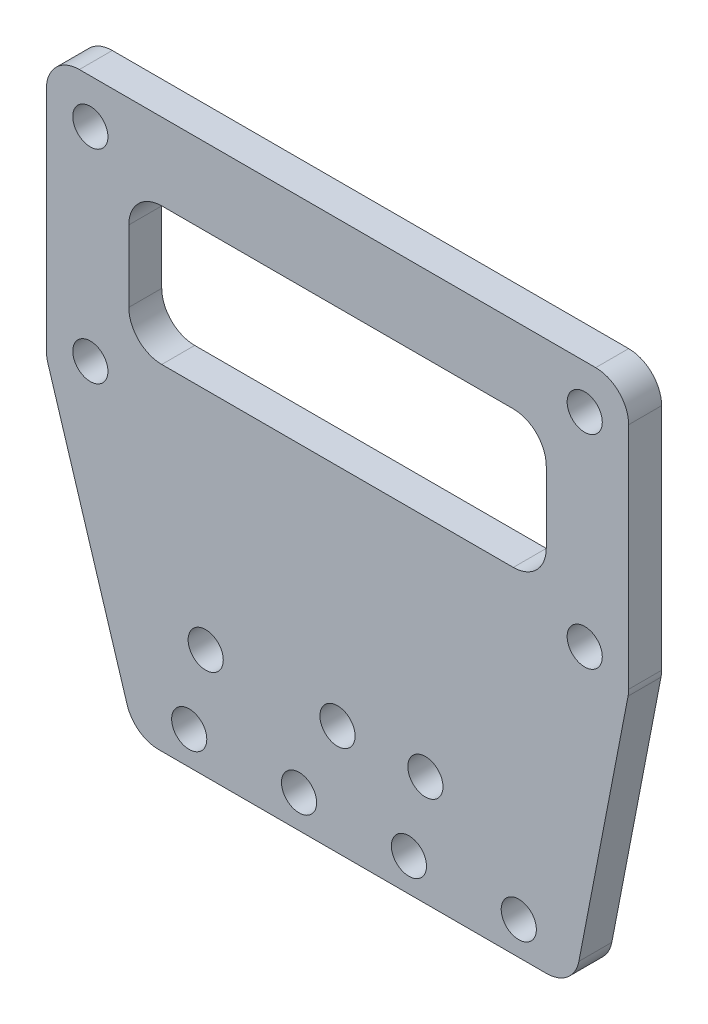
ISO-10303-21;
HEADER;
FILE_DESCRIPTION(('STEP AP214'),'2;1');
FILE_NAME('part.step','',(''),(''),'','','');
FILE_SCHEMA(('AUTOMOTIVE_DESIGN { 1 0 10303 214 1 1 1 1 }'));
ENDSEC;
DATA;
#1=APPLICATION_CONTEXT('core data for automotive mechanical design processes');
#2=APPLICATION_PROTOCOL_DEFINITION('international standard','automotive_design',2000,#1);
#3=PRODUCT_CONTEXT('',#1,'mechanical');
#4=PRODUCT('Part','Part','',(#3));
#5=PRODUCT_RELATED_PRODUCT_CATEGORY('part','',(#4));
#6=PRODUCT_DEFINITION_FORMATION('','',#4);
#7=PRODUCT_DEFINITION_CONTEXT('part definition',#1,'design');
#8=PRODUCT_DEFINITION('design','',#6,#7);
#9=PRODUCT_DEFINITION_SHAPE('','',#8);
#10=(LENGTH_UNIT() NAMED_UNIT(*) SI_UNIT(.MILLI.,.METRE.));
#11=(NAMED_UNIT(*) PLANE_ANGLE_UNIT() SI_UNIT($,.RADIAN.));
#12=(NAMED_UNIT(*) SI_UNIT($,.STERADIAN.) SOLID_ANGLE_UNIT());
#13=UNCERTAINTY_MEASURE_WITH_UNIT(LENGTH_MEASURE(1.E-05),#10,'distance_accuracy_value','');
#14=(GEOMETRIC_REPRESENTATION_CONTEXT(3) GLOBAL_UNCERTAINTY_ASSIGNED_CONTEXT((#13)) GLOBAL_UNIT_ASSIGNED_CONTEXT((#10,
#11,#12)) REPRESENTATION_CONTEXT('',''));
#15=CARTESIAN_POINT('',(0.,0.,0.));
#16=DIRECTION('',(0.,0.,1.));
#17=DIRECTION('',(1.,0.,0.));
#18=AXIS2_PLACEMENT_3D('',#15,#16,#17);
#19=CARTESIAN_POINT('',(0.,0.,3.));
#20=DIRECTION('',(0.,0.,-1.));
#21=DIRECTION('',(-1.,0.,0.));
#22=AXIS2_PLACEMENT_3D('',#19,#20,#21);
#23=PLANE('',#22);
#24=DIRECTION('',(-1.,0.,0.));
#25=VECTOR('',#24,1.);
#26=CARTESIAN_POINT('',(-40.5,43.,3.));
#27=LINE('',#26,#25);
#28=CARTESIAN_POINT('',(-5.50000000000001,43.,3.));
#29=VERTEX_POINT('',#28);
#30=CARTESIAN_POINT('',(-37.5,43.,3.));
#31=VERTEX_POINT('',#30);
#32=EDGE_CURVE('E199',#29,#31,#27,.T.);
#33=ORIENTED_EDGE('',*,*,#32,.F.);
#34=CARTESIAN_POINT('',(-5.50000000000001,40.,3.));
#35=DIRECTION('',(0.,0.,-1.));
#36=DIRECTION('',(-1.,0.,0.));
#37=AXIS2_PLACEMENT_3D('',#34,#35,#36);
#38=CIRCLE('',#37,3.);
#39=CARTESIAN_POINT('',(-2.5,40.,3.));
#40=VERTEX_POINT('',#39);
#41=EDGE_CURVE('E198',#29,#40,#38,.T.);
#42=ORIENTED_EDGE('',*,*,#41,.T.);
#43=DIRECTION('',(0.,1.,0.));
#44=VECTOR('',#43,1.);
#45=CARTESIAN_POINT('',(-2.5,43.,3.));
#46=LINE('',#45,#44);
#47=CARTESIAN_POINT('',(-2.5,33.5,3.));
#48=VERTEX_POINT('',#47);
#49=EDGE_CURVE('E189',#48,#40,#46,.T.);
#50=ORIENTED_EDGE('',*,*,#49,.F.);
#51=CARTESIAN_POINT('',(-5.5,33.5,3.));
#52=DIRECTION('',(0.,0.,-1.));
#53=DIRECTION('',(-1.,0.,0.));
#54=AXIS2_PLACEMENT_3D('',#51,#52,#53);
#55=CIRCLE('',#54,3.);
#56=CARTESIAN_POINT('',(-5.50000000000001,30.5,3.));
#57=VERTEX_POINT('',#56);
#58=EDGE_CURVE('E172',#48,#57,#55,.T.);
#59=ORIENTED_EDGE('',*,*,#58,.T.);
#60=DIRECTION('',(1.,0.,0.));
#61=VECTOR('',#60,1.);
#62=CARTESIAN_POINT('',(-40.5,30.5,3.));
#63=LINE('',#62,#61);
#64=CARTESIAN_POINT('',(-37.5,30.5,3.));
#65=VERTEX_POINT('',#64);
#66=EDGE_CURVE('E210',#65,#57,#63,.T.);
#67=ORIENTED_EDGE('',*,*,#66,.F.);
#68=CARTESIAN_POINT('',(-37.5,33.5,3.));
#69=DIRECTION('',(0.,0.,-1.));
#70=DIRECTION('',(-1.,0.,0.));
#71=AXIS2_PLACEMENT_3D('',#68,#69,#70);
#72=CIRCLE('',#71,3.);
#73=CARTESIAN_POINT('',(-40.5,33.5,3.));
#74=VERTEX_POINT('',#73);
#75=EDGE_CURVE('E42',#65,#74,#72,.T.);
#76=ORIENTED_EDGE('',*,*,#75,.T.);
#77=DIRECTION('',(0.,-1.,0.));
#78=VECTOR('',#77,1.);
#79=CARTESIAN_POINT('',(-40.5,43.,3.));
#80=LINE('',#79,#78);
#81=CARTESIAN_POINT('',(-40.5,40.,3.));
#82=VERTEX_POINT('',#81);
#83=EDGE_CURVE('E202',#82,#74,#80,.T.);
#84=ORIENTED_EDGE('',*,*,#83,.F.);
#85=CARTESIAN_POINT('',(-37.5,40.,3.));
#86=DIRECTION('',(0.,0.,-1.));
#87=DIRECTION('',(-1.,0.,0.));
#88=AXIS2_PLACEMENT_3D('',#85,#86,#87);
#89=CIRCLE('',#88,3.);
#90=EDGE_CURVE('E380',#82,#31,#89,.T.);
#91=ORIENTED_EDGE('',*,*,#90,.T.);
#92=EDGE_LOOP('',(#33,#42,#50,#59,#67,#76,#84,#91));
#93=FACE_BOUND('',#92,.T.);
#94=CARTESIAN_POINT('',(-13.5,10.,3.));
#95=DIRECTION('',(0.,0.,1.));
#96=DIRECTION('',(1.,0.,0.));
#97=AXIS2_PLACEMENT_3D('',#94,#95,#96);
#98=CIRCLE('',#97,1.6);
#99=CARTESIAN_POINT('',(-11.9,10.,3.));
#100=VERTEX_POINT('',#99);
#101=EDGE_CURVE('E222',#100,#100,#98,.T.);
#102=ORIENTED_EDGE('',*,*,#101,.F.);
#103=EDGE_LOOP('',(#102));
#104=FACE_BOUND('',#103,.T.);
#105=CARTESIAN_POINT('',(-33.5,10.,3.));
#106=DIRECTION('',(0.,0.,1.));
#107=DIRECTION('',(1.,0.,0.));
#108=AXIS2_PLACEMENT_3D('',#105,#106,#107);
#109=CIRCLE('',#108,1.6);
#110=CARTESIAN_POINT('',(-31.9,10.,3.));
#111=VERTEX_POINT('',#110);
#112=EDGE_CURVE('E216',#111,#111,#109,.T.);
#113=ORIENTED_EDGE('',*,*,#112,.F.);
#114=EDGE_LOOP('',(#113));
#115=FACE_BOUND('',#114,.T.);
#116=CARTESIAN_POINT('',(-21.5,10.,3.));
#117=DIRECTION('',(0.,0.,1.));
#118=DIRECTION('',(1.,0.,0.));
#119=AXIS2_PLACEMENT_3D('',#116,#117,#118);
#120=CIRCLE('',#119,1.6);
#121=CARTESIAN_POINT('',(-19.9,10.,3.));
#122=VERTEX_POINT('',#121);
#123=EDGE_CURVE('E215',#122,#122,#120,.T.);
#124=ORIENTED_EDGE('',*,*,#123,.F.);
#125=EDGE_LOOP('',(#124));
#126=FACE_BOUND('',#125,.T.);
#127=CARTESIAN_POINT('',(-5.,3.,3.));
#128=DIRECTION('',(0.,0.,1.));
#129=DIRECTION('',(1.,0.,0.));
#130=AXIS2_PLACEMENT_3D('',#127,#128,#129);
#131=CIRCLE('',#130,1.6);
#132=CARTESIAN_POINT('',(-3.4,3.,3.));
#133=VERTEX_POINT('',#132);
#134=EDGE_CURVE('E235',#133,#133,#131,.T.);
#135=ORIENTED_EDGE('',*,*,#134,.F.);
#136=EDGE_LOOP('',(#135));
#137=FACE_BOUND('',#136,.T.);
#138=CARTESIAN_POINT('',(-15.,2.99999999999993,3.));
#139=DIRECTION('',(0.,0.,1.));
#140=DIRECTION('',(1.,0.,0.));
#141=AXIS2_PLACEMENT_3D('',#138,#139,#140);
#142=CIRCLE('',#141,1.6);
#143=CARTESIAN_POINT('',(-13.4,2.99999999999993,3.));
#144=VERTEX_POINT('',#143);
#145=EDGE_CURVE('E241',#144,#144,#142,.T.);
#146=ORIENTED_EDGE('',*,*,#145,.F.);
#147=EDGE_LOOP('',(#146));
#148=FACE_BOUND('',#147,.T.);
#149=CARTESIAN_POINT('',(-25.,2.99999999999986,3.));
#150=DIRECTION('',(0.,0.,1.));
#151=DIRECTION('',(1.,0.,0.));
#152=AXIS2_PLACEMENT_3D('',#149,#150,#151);
#153=CIRCLE('',#152,1.6);
#154=CARTESIAN_POINT('',(-23.4,2.99999999999986,3.));
#155=VERTEX_POINT('',#154);
#156=EDGE_CURVE('E247',#155,#155,#153,.T.);
#157=ORIENTED_EDGE('',*,*,#156,.F.);
#158=EDGE_LOOP('',(#157));
#159=FACE_BOUND('',#158,.T.);
#160=CARTESIAN_POINT('',(-35.,2.99999999999979,3.));
#161=DIRECTION('',(0.,0.,1.));
#162=DIRECTION('',(1.,0.,0.));
#163=AXIS2_PLACEMENT_3D('',#160,#161,#162);
#164=CIRCLE('',#163,1.6);
#165=CARTESIAN_POINT('',(-33.4,2.99999999999979,3.));
#166=VERTEX_POINT('',#165);
#167=EDGE_CURVE('E228',#166,#166,#164,.T.);
#168=ORIENTED_EDGE('',*,*,#167,.F.);
#169=EDGE_LOOP('',(#168));
#170=FACE_BOUND('',#169,.T.);
#171=DIRECTION('',(1.,0.,0.));
#172=VECTOR('',#171,1.);
#173=CARTESIAN_POINT('',(0.,0.,3.));
#174=LINE('',#173,#172);
#175=CARTESIAN_POINT('',(-37.7879124649345,0.,3.));
#176=VERTEX_POINT('',#175);
#177=CARTESIAN_POINT('',(-2.4754339502552,0.,3.));
#178=VERTEX_POINT('',#177);
#179=EDGE_CURVE('E293',#176,#178,#174,.T.);
#180=ORIENTED_EDGE('',*,*,#179,.T.);
#181=CARTESIAN_POINT('',(-2.4754339502552,3.,3.));
#182=DIRECTION('',(0.,0.,-1.));
#183=DIRECTION('',(-1.,0.,0.));
#184=AXIS2_PLACEMENT_3D('',#181,#182,#183);
#185=CIRCLE('',#184,3.);
#186=CARTESIAN_POINT('',(0.469996972827484,2.43040656837679,3.));
#187=VERTEX_POINT('',#186);
#188=EDGE_CURVE('E356',#178,#187,#185,.F.);
#189=ORIENTED_EDGE('',*,*,#188,.T.);
#190=DIRECTION('',(0.189864477207736,0.981810307694227,0.));
#191=VECTOR('',#190,1.);
#192=CARTESIAN_POINT('',(5.,25.8555555555556,3.));
#193=LINE('',#192,#191);
#194=CARTESIAN_POINT('',(4.94543092308268,25.5733727955853,3.));
#195=VERTEX_POINT('',#194);
#196=EDGE_CURVE('E279',#187,#195,#193,.T.);
#197=ORIENTED_EDGE('',*,*,#196,.T.);
#198=CARTESIAN_POINT('',(2.,26.1429662272085,3.));
#199=DIRECTION('',(0.,0.,-1.));
#200=DIRECTION('',(-1.,0.,0.));
#201=AXIS2_PLACEMENT_3D('',#198,#199,#200);
#202=CIRCLE('',#201,3.);
#203=CARTESIAN_POINT('',(5.,26.1429662272085,3.));
#204=VERTEX_POINT('',#203);
#205=EDGE_CURVE('E354',#195,#204,#202,.F.);
#206=ORIENTED_EDGE('',*,*,#205,.T.);
#207=DIRECTION('',(0.,1.,0.));
#208=VECTOR('',#207,1.);
#209=CARTESIAN_POINT('',(5.,50.,3.));
#210=LINE('',#209,#208);
#211=CARTESIAN_POINT('',(5.,47.,3.));
#212=VERTEX_POINT('',#211);
#213=EDGE_CURVE('E282',#204,#212,#210,.T.);
#214=ORIENTED_EDGE('',*,*,#213,.T.);
#215=CARTESIAN_POINT('',(1.99999999999999,47.,3.));
#216=DIRECTION('',(0.,0.,-1.));
#217=DIRECTION('',(-1.,0.,0.));
#218=AXIS2_PLACEMENT_3D('',#215,#216,#217);
#219=CIRCLE('',#218,3.);
#220=CARTESIAN_POINT('',(1.99999999999999,50.,3.));
#221=VERTEX_POINT('',#220);
#222=EDGE_CURVE('E352',#212,#221,#219,.F.);
#223=ORIENTED_EDGE('',*,*,#222,.T.);
#224=DIRECTION('',(-1.,0.,0.));
#225=VECTOR('',#224,1.);
#226=CARTESIAN_POINT('',(-48.,50.,3.));
#227=LINE('',#226,#225);
#228=CARTESIAN_POINT('',(-45.,50.,3.));
#229=VERTEX_POINT('',#228);
#230=EDGE_CURVE('E286',#221,#229,#227,.T.);
#231=ORIENTED_EDGE('',*,*,#230,.T.);
#232=CARTESIAN_POINT('',(-45.,47.,3.));
#233=DIRECTION('',(0.,0.,-1.));
#234=DIRECTION('',(-1.,0.,0.));
#235=AXIS2_PLACEMENT_3D('',#232,#233,#234);
#236=CIRCLE('',#235,3.);
#237=CARTESIAN_POINT('',(-48.,47.,3.));
#238=VERTEX_POINT('',#237);
#239=EDGE_CURVE('E350',#229,#238,#236,.F.);
#240=ORIENTED_EDGE('',*,*,#239,.T.);
#241=DIRECTION('',(0.,-1.,0.));
#242=VECTOR('',#241,1.);
#243=CARTESIAN_POINT('',(-48.,25.8555555555555,3.));
#244=LINE('',#243,#242);
#245=CARTESIAN_POINT('',(-48.,26.3090662418019,3.));
#246=VERTEX_POINT('',#245);
#247=EDGE_CURVE('E289',#238,#246,#244,.T.);
#248=ORIENTED_EDGE('',*,*,#247,.T.);
#249=CARTESIAN_POINT('',(-45.,26.3090662418019,3.));
#250=DIRECTION('',(0.,0.,-1.));
#251=DIRECTION('',(-1.,0.,0.));
#252=AXIS2_PLACEMENT_3D('',#249,#250,#251);
#253=CIRCLE('',#252,3.);
#254=CARTESIAN_POINT('',(-47.8659487690914,25.4223094245497,3.));
#255=VERTEX_POINT('',#254);
#256=EDGE_CURVE('E56',#246,#255,#253,.F.);
#257=ORIENTED_EDGE('',*,*,#256,.T.);
#258=DIRECTION('',(0.295585605750729,-0.955316256363815,0.));
#259=VECTOR('',#258,1.);
#260=CARTESIAN_POINT('',(-40.,0.,3.));
#261=LINE('',#260,#259);
#262=CARTESIAN_POINT('',(-40.653861234026,2.11324318274781,3.));
#263=VERTEX_POINT('',#262);
#264=EDGE_CURVE('E291',#255,#263,#261,.T.);
#265=ORIENTED_EDGE('',*,*,#264,.T.);
#266=CARTESIAN_POINT('',(-37.7879124649345,3.,3.));
#267=DIRECTION('',(0.,0.,-1.));
#268=DIRECTION('',(-1.,0.,0.));
#269=AXIS2_PLACEMENT_3D('',#266,#267,#268);
#270=CIRCLE('',#269,3.);
#271=EDGE_CURVE('E347',#263,#176,#270,.F.);
#272=ORIENTED_EDGE('',*,*,#271,.T.);
#273=EDGE_LOOP('',(#180,#189,#197,#206,#214,#223,#231,#240,#248,#257,#265,#272));
#274=FACE_BOUND('',#273,.T.);
#275=CARTESIAN_POINT('',(1.,46.,3.));
#276=DIRECTION('',(0.,0.,1.));
#277=DIRECTION('',(1.,0.,0.));
#278=AXIS2_PLACEMENT_3D('',#275,#276,#277);
#279=CIRCLE('',#278,1.59999999999999);
#280=CARTESIAN_POINT('',(2.59999999999999,46.,3.));
#281=VERTEX_POINT('',#280);
#282=EDGE_CURVE('E273',#281,#281,#279,.T.);
#283=ORIENTED_EDGE('',*,*,#282,.F.);
#284=EDGE_LOOP('',(#283));
#285=FACE_BOUND('',#284,.T.);
#286=CARTESIAN_POINT('',(-44.,46.,3.));
#287=DIRECTION('',(0.,0.,1.));
#288=DIRECTION('',(1.,0.,0.));
#289=AXIS2_PLACEMENT_3D('',#286,#287,#288);
#290=CIRCLE('',#289,1.6);
#291=CARTESIAN_POINT('',(-42.4,46.,3.));
#292=VERTEX_POINT('',#291);
#293=EDGE_CURVE('E267',#292,#292,#290,.T.);
#294=ORIENTED_EDGE('',*,*,#293,.F.);
#295=EDGE_LOOP('',(#294));
#296=FACE_BOUND('',#295,.T.);
#297=CARTESIAN_POINT('',(1.,27.5,3.));
#298=DIRECTION('',(0.,0.,1.));
#299=DIRECTION('',(1.,0.,0.));
#300=AXIS2_PLACEMENT_3D('',#297,#298,#299);
#301=CIRCLE('',#300,1.6);
#302=CARTESIAN_POINT('',(2.6,27.5,3.));
#303=VERTEX_POINT('',#302);
#304=EDGE_CURVE('E261',#303,#303,#301,.T.);
#305=ORIENTED_EDGE('',*,*,#304,.F.);
#306=EDGE_LOOP('',(#305));
#307=FACE_BOUND('',#306,.T.);
#308=CARTESIAN_POINT('',(-44.,27.5,3.));
#309=DIRECTION('',(0.,0.,1.));
#310=DIRECTION('',(1.,0.,0.));
#311=AXIS2_PLACEMENT_3D('',#308,#309,#310);
#312=CIRCLE('',#311,1.6);
#313=CARTESIAN_POINT('',(-42.4,27.5,3.));
#314=VERTEX_POINT('',#313);
#315=EDGE_CURVE('E255',#314,#314,#312,.T.);
#316=ORIENTED_EDGE('',*,*,#315,.F.);
#317=EDGE_LOOP('',(#316));
#318=FACE_BOUND('',#317,.T.);
#319=ADVANCED_FACE('F34',(#93,#104,#115,#126,#137,#148,#159,#170,#274,#285,#296,#307,#318),#23,.F.);
#320=CARTESIAN_POINT('',(0.,0.,0.));
#321=DIRECTION('',(0.,0.,-1.));
#322=DIRECTION('',(-1.,0.,0.));
#323=AXIS2_PLACEMENT_3D('',#320,#321,#322);
#324=PLANE('',#323);
#325=DIRECTION('',(1.,0.,0.));
#326=VECTOR('',#325,1.);
#327=CARTESIAN_POINT('',(-40.5,30.5,0.));
#328=LINE('',#327,#326);
#329=CARTESIAN_POINT('',(-37.5,30.5,0.));
#330=VERTEX_POINT('',#329);
#331=CARTESIAN_POINT('',(-5.50000000000001,30.5,0.));
#332=VERTEX_POINT('',#331);
#333=EDGE_CURVE('E205',#330,#332,#328,.T.);
#334=ORIENTED_EDGE('',*,*,#333,.T.);
#335=CARTESIAN_POINT('',(-5.5,33.5,0.));
#336=DIRECTION('',(0.,0.,-1.));
#337=DIRECTION('',(-1.,0.,0.));
#338=AXIS2_PLACEMENT_3D('',#335,#336,#337);
#339=CIRCLE('',#338,3.);
#340=CARTESIAN_POINT('',(-2.5,33.5,0.));
#341=VERTEX_POINT('',#340);
#342=EDGE_CURVE('E182',#332,#341,#339,.F.);
#343=ORIENTED_EDGE('',*,*,#342,.T.);
#344=DIRECTION('',(0.,1.,0.));
#345=VECTOR('',#344,1.);
#346=CARTESIAN_POINT('',(-2.5,43.,0.));
#347=LINE('',#346,#345);
#348=CARTESIAN_POINT('',(-2.5,40.,0.));
#349=VERTEX_POINT('',#348);
#350=EDGE_CURVE('E192',#341,#349,#347,.T.);
#351=ORIENTED_EDGE('',*,*,#350,.T.);
#352=CARTESIAN_POINT('',(-5.50000000000001,40.,0.));
#353=DIRECTION('',(0.,0.,-1.));
#354=DIRECTION('',(-1.,0.,0.));
#355=AXIS2_PLACEMENT_3D('',#352,#353,#354);
#356=CIRCLE('',#355,3.);
#357=CARTESIAN_POINT('',(-5.50000000000001,43.,0.));
#358=VERTEX_POINT('',#357);
#359=EDGE_CURVE('E378',#349,#358,#356,.F.);
#360=ORIENTED_EDGE('',*,*,#359,.T.);
#361=DIRECTION('',(-1.,0.,0.));
#362=VECTOR('',#361,1.);
#363=CARTESIAN_POINT('',(-40.5,43.,0.));
#364=LINE('',#363,#362);
#365=CARTESIAN_POINT('',(-37.5,43.,0.));
#366=VERTEX_POINT('',#365);
#367=EDGE_CURVE('E402',#358,#366,#364,.T.);
#368=ORIENTED_EDGE('',*,*,#367,.T.);
#369=CARTESIAN_POINT('',(-37.5,40.,0.));
#370=DIRECTION('',(0.,0.,-1.));
#371=DIRECTION('',(-1.,0.,0.));
#372=AXIS2_PLACEMENT_3D('',#369,#370,#371);
#373=CIRCLE('',#372,3.);
#374=CARTESIAN_POINT('',(-40.5,40.,0.));
#375=VERTEX_POINT('',#374);
#376=EDGE_CURVE('E382',#366,#375,#373,.F.);
#377=ORIENTED_EDGE('',*,*,#376,.T.);
#378=DIRECTION('',(0.,-1.,0.));
#379=VECTOR('',#378,1.);
#380=CARTESIAN_POINT('',(-40.5,43.,0.));
#381=LINE('',#380,#379);
#382=CARTESIAN_POINT('',(-40.5,33.5,0.));
#383=VERTEX_POINT('',#382);
#384=EDGE_CURVE('E399',#375,#383,#381,.T.);
#385=ORIENTED_EDGE('',*,*,#384,.T.);
#386=CARTESIAN_POINT('',(-37.5,33.5,0.));
#387=DIRECTION('',(0.,0.,-1.));
#388=DIRECTION('',(-1.,0.,0.));
#389=AXIS2_PLACEMENT_3D('',#386,#387,#388);
#390=CIRCLE('',#389,3.);
#391=EDGE_CURVE('E11',#383,#330,#390,.F.);
#392=ORIENTED_EDGE('',*,*,#391,.T.);
#393=EDGE_LOOP('',(#334,#343,#351,#360,#368,#377,#385,#392));
#394=FACE_BOUND('',#393,.T.);
#395=CARTESIAN_POINT('',(-13.5,10.,0.));
#396=DIRECTION('',(0.,0.,1.));
#397=DIRECTION('',(1.,0.,0.));
#398=AXIS2_PLACEMENT_3D('',#395,#396,#397);
#399=CIRCLE('',#398,1.6);
#400=CARTESIAN_POINT('',(-11.9,10.,0.));
#401=VERTEX_POINT('',#400);
#402=EDGE_CURVE('E219',#401,#401,#399,.T.);
#403=ORIENTED_EDGE('',*,*,#402,.T.);
#404=EDGE_LOOP('',(#403));
#405=FACE_BOUND('',#404,.T.);
#406=CARTESIAN_POINT('',(-33.5,10.,0.));
#407=DIRECTION('',(0.,0.,1.));
#408=DIRECTION('',(1.,0.,0.));
#409=AXIS2_PLACEMENT_3D('',#406,#407,#408);
#410=CIRCLE('',#409,1.6);
#411=CARTESIAN_POINT('',(-31.9,10.,0.));
#412=VERTEX_POINT('',#411);
#413=EDGE_CURVE('E212',#412,#412,#410,.T.);
#414=ORIENTED_EDGE('',*,*,#413,.T.);
#415=EDGE_LOOP('',(#414));
#416=FACE_BOUND('',#415,.T.);
#417=CARTESIAN_POINT('',(-21.5,10.,0.));
#418=DIRECTION('',(0.,0.,1.));
#419=DIRECTION('',(1.,0.,0.));
#420=AXIS2_PLACEMENT_3D('',#417,#418,#419);
#421=CIRCLE('',#420,1.6);
#422=CARTESIAN_POINT('',(-19.9,10.,0.));
#423=VERTEX_POINT('',#422);
#424=EDGE_CURVE('E225',#423,#423,#421,.T.);
#425=ORIENTED_EDGE('',*,*,#424,.T.);
#426=EDGE_LOOP('',(#425));
#427=FACE_BOUND('',#426,.T.);
#428=CARTESIAN_POINT('',(-5.,3.,0.));
#429=DIRECTION('',(0.,0.,1.));
#430=DIRECTION('',(1.,0.,0.));
#431=AXIS2_PLACEMENT_3D('',#428,#429,#430);
#432=CIRCLE('',#431,1.6);
#433=CARTESIAN_POINT('',(-3.4,3.,0.));
#434=VERTEX_POINT('',#433);
#435=EDGE_CURVE('E231',#434,#434,#432,.T.);
#436=ORIENTED_EDGE('',*,*,#435,.T.);
#437=EDGE_LOOP('',(#436));
#438=FACE_BOUND('',#437,.T.);
#439=CARTESIAN_POINT('',(-15.,2.99999999999993,0.));
#440=DIRECTION('',(0.,0.,1.));
#441=DIRECTION('',(1.,0.,0.));
#442=AXIS2_PLACEMENT_3D('',#439,#440,#441);
#443=CIRCLE('',#442,1.6);
#444=CARTESIAN_POINT('',(-13.4,2.99999999999993,0.));
#445=VERTEX_POINT('',#444);
#446=EDGE_CURVE('E238',#445,#445,#443,.T.);
#447=ORIENTED_EDGE('',*,*,#446,.T.);
#448=EDGE_LOOP('',(#447));
#449=FACE_BOUND('',#448,.T.);
#450=CARTESIAN_POINT('',(-25.,2.99999999999986,0.));
#451=DIRECTION('',(0.,0.,1.));
#452=DIRECTION('',(1.,0.,0.));
#453=AXIS2_PLACEMENT_3D('',#450,#451,#452);
#454=CIRCLE('',#453,1.6);
#455=CARTESIAN_POINT('',(-23.4,2.99999999999986,0.));
#456=VERTEX_POINT('',#455);
#457=EDGE_CURVE('E244',#456,#456,#454,.T.);
#458=ORIENTED_EDGE('',*,*,#457,.T.);
#459=EDGE_LOOP('',(#458));
#460=FACE_BOUND('',#459,.T.);
#461=CARTESIAN_POINT('',(-35.,2.99999999999979,0.));
#462=DIRECTION('',(0.,0.,1.));
#463=DIRECTION('',(1.,0.,0.));
#464=AXIS2_PLACEMENT_3D('',#461,#462,#463);
#465=CIRCLE('',#464,1.6);
#466=CARTESIAN_POINT('',(-33.4,2.99999999999979,0.));
#467=VERTEX_POINT('',#466);
#468=EDGE_CURVE('E250',#467,#467,#465,.T.);
#469=ORIENTED_EDGE('',*,*,#468,.T.);
#470=EDGE_LOOP('',(#469));
#471=FACE_BOUND('',#470,.T.);
#472=CARTESIAN_POINT('',(1.,27.5,0.));
#473=DIRECTION('',(0.,0.,1.));
#474=DIRECTION('',(1.,0.,0.));
#475=AXIS2_PLACEMENT_3D('',#472,#473,#474);
#476=CIRCLE('',#475,1.6);
#477=CARTESIAN_POINT('',(2.6,27.5,0.));
#478=VERTEX_POINT('',#477);
#479=EDGE_CURVE('E258',#478,#478,#476,.T.);
#480=ORIENTED_EDGE('',*,*,#479,.T.);
#481=EDGE_LOOP('',(#480));
#482=FACE_BOUND('',#481,.T.);
#483=CARTESIAN_POINT('',(1.,46.,0.));
#484=DIRECTION('',(0.,0.,1.));
#485=DIRECTION('',(1.,0.,0.));
#486=AXIS2_PLACEMENT_3D('',#483,#484,#485);
#487=CIRCLE('',#486,1.59999999999999);
#488=CARTESIAN_POINT('',(2.59999999999999,46.,0.));
#489=VERTEX_POINT('',#488);
#490=EDGE_CURVE('E270',#489,#489,#487,.T.);
#491=ORIENTED_EDGE('',*,*,#490,.T.);
#492=EDGE_LOOP('',(#491));
#493=FACE_BOUND('',#492,.T.);
#494=DIRECTION('',(0.189864477207736,0.981810307694227,0.));
#495=VECTOR('',#494,1.);
#496=CARTESIAN_POINT('',(5.,25.8555555555556,0.));
#497=LINE('',#496,#495);
#498=CARTESIAN_POINT('',(0.469996972827484,2.43040656837679,0.));
#499=VERTEX_POINT('',#498);
#500=CARTESIAN_POINT('',(4.94543092308268,25.5733727955853,0.));
#501=VERTEX_POINT('',#500);
#502=EDGE_CURVE('E276',#499,#501,#497,.T.);
#503=ORIENTED_EDGE('',*,*,#502,.F.);
#504=CARTESIAN_POINT('',(-2.4754339502552,3.,0.));
#505=DIRECTION('',(0.,0.,-1.));
#506=DIRECTION('',(-1.,0.,0.));
#507=AXIS2_PLACEMENT_3D('',#504,#505,#506);
#508=CIRCLE('',#507,3.);
#509=CARTESIAN_POINT('',(-2.4754339502552,0.,0.));
#510=VERTEX_POINT('',#509);
#511=EDGE_CURVE('E340',#499,#510,#508,.T.);
#512=ORIENTED_EDGE('',*,*,#511,.T.);
#513=DIRECTION('',(1.,0.,0.));
#514=VECTOR('',#513,1.);
#515=CARTESIAN_POINT('',(0.,0.,0.));
#516=LINE('',#515,#514);
#517=CARTESIAN_POINT('',(-37.7879124649345,0.,0.));
#518=VERTEX_POINT('',#517);
#519=EDGE_CURVE('E283',#518,#510,#516,.T.);
#520=ORIENTED_EDGE('',*,*,#519,.F.);
#521=CARTESIAN_POINT('',(-37.7879124649345,3.,0.));
#522=DIRECTION('',(0.,0.,-1.));
#523=DIRECTION('',(-1.,0.,0.));
#524=AXIS2_PLACEMENT_3D('',#521,#522,#523);
#525=CIRCLE('',#524,3.);
#526=CARTESIAN_POINT('',(-40.653861234026,2.11324318274781,0.));
#527=VERTEX_POINT('',#526);
#528=EDGE_CURVE('E330',#518,#527,#525,.T.);
#529=ORIENTED_EDGE('',*,*,#528,.T.);
#530=DIRECTION('',(0.295585605750729,-0.955316256363815,0.));
#531=VECTOR('',#530,1.);
#532=CARTESIAN_POINT('',(-40.,0.,0.));
#533=LINE('',#532,#531);
#534=CARTESIAN_POINT('',(-47.8659487690914,25.4223094245497,0.));
#535=VERTEX_POINT('',#534);
#536=EDGE_CURVE('E307',#535,#527,#533,.T.);
#537=ORIENTED_EDGE('',*,*,#536,.F.);
#538=CARTESIAN_POINT('',(-45.,26.3090662418019,0.));
#539=DIRECTION('',(0.,0.,-1.));
#540=DIRECTION('',(-1.,0.,0.));
#541=AXIS2_PLACEMENT_3D('',#538,#539,#540);
#542=CIRCLE('',#541,3.);
#543=CARTESIAN_POINT('',(-48.,26.3090662418019,0.));
#544=VERTEX_POINT('',#543);
#545=EDGE_CURVE('E332',#535,#544,#542,.T.);
#546=ORIENTED_EDGE('',*,*,#545,.T.);
#547=DIRECTION('',(0.,-1.,0.));
#548=VECTOR('',#547,1.);
#549=CARTESIAN_POINT('',(-48.,25.8555555555555,0.));
#550=LINE('',#549,#548);
#551=CARTESIAN_POINT('',(-48.,47.,0.));
#552=VERTEX_POINT('',#551);
#553=EDGE_CURVE('E304',#552,#544,#550,.T.);
#554=ORIENTED_EDGE('',*,*,#553,.F.);
#555=CARTESIAN_POINT('',(-45.,47.,0.));
#556=DIRECTION('',(0.,0.,-1.));
#557=DIRECTION('',(-1.,0.,0.));
#558=AXIS2_PLACEMENT_3D('',#555,#556,#557);
#559=CIRCLE('',#558,3.);
#560=CARTESIAN_POINT('',(-45.,50.,0.));
#561=VERTEX_POINT('',#560);
#562=EDGE_CURVE('E334',#552,#561,#559,.T.);
#563=ORIENTED_EDGE('',*,*,#562,.T.);
#564=DIRECTION('',(-1.,0.,0.));
#565=VECTOR('',#564,1.);
#566=CARTESIAN_POINT('',(-48.,50.,0.));
#567=LINE('',#566,#565);
#568=CARTESIAN_POINT('',(1.99999999999999,50.,0.));
#569=VERTEX_POINT('',#568);
#570=EDGE_CURVE('E301',#569,#561,#567,.T.);
#571=ORIENTED_EDGE('',*,*,#570,.F.);
#572=CARTESIAN_POINT('',(1.99999999999999,47.,0.));
#573=DIRECTION('',(0.,0.,-1.));
#574=DIRECTION('',(-1.,0.,0.));
#575=AXIS2_PLACEMENT_3D('',#572,#573,#574);
#576=CIRCLE('',#575,3.);
#577=CARTESIAN_POINT('',(5.,47.,0.));
#578=VERTEX_POINT('',#577);
#579=EDGE_CURVE('E336',#569,#578,#576,.T.);
#580=ORIENTED_EDGE('',*,*,#579,.T.);
#581=DIRECTION('',(0.,1.,0.));
#582=VECTOR('',#581,1.);
#583=CARTESIAN_POINT('',(5.,50.,0.));
#584=LINE('',#583,#582);
#585=CARTESIAN_POINT('',(5.,26.1429662272085,0.));
#586=VERTEX_POINT('',#585);
#587=EDGE_CURVE('E298',#586,#578,#584,.T.);
#588=ORIENTED_EDGE('',*,*,#587,.F.);
#589=CARTESIAN_POINT('',(2.,26.1429662272085,0.));
#590=DIRECTION('',(0.,0.,-1.));
#591=DIRECTION('',(-1.,0.,0.));
#592=AXIS2_PLACEMENT_3D('',#589,#590,#591);
#593=CIRCLE('',#592,3.);
#594=EDGE_CURVE('E338',#586,#501,#593,.T.);
#595=ORIENTED_EDGE('',*,*,#594,.T.);
#596=EDGE_LOOP('',(#503,#512,#520,#529,#537,#546,#554,#563,#571,#580,#588,#595));
#597=FACE_BOUND('',#596,.T.);
#598=CARTESIAN_POINT('',(-44.,46.,0.));
#599=DIRECTION('',(0.,0.,1.));
#600=DIRECTION('',(1.,0.,0.));
#601=AXIS2_PLACEMENT_3D('',#598,#599,#600);
#602=CIRCLE('',#601,1.6);
#603=CARTESIAN_POINT('',(-42.4,46.,0.));
#604=VERTEX_POINT('',#603);
#605=EDGE_CURVE('E264',#604,#604,#602,.T.);
#606=ORIENTED_EDGE('',*,*,#605,.T.);
#607=EDGE_LOOP('',(#606));
#608=FACE_BOUND('',#607,.T.);
#609=CARTESIAN_POINT('',(-44.,27.5,0.));
#610=DIRECTION('',(0.,0.,1.));
#611=DIRECTION('',(1.,0.,0.));
#612=AXIS2_PLACEMENT_3D('',#609,#610,#611);
#613=CIRCLE('',#612,1.6);
#614=CARTESIAN_POINT('',(-42.4,27.5,0.));
#615=VERTEX_POINT('',#614);
#616=EDGE_CURVE('E234',#615,#615,#613,.T.);
#617=ORIENTED_EDGE('',*,*,#616,.T.);
#618=EDGE_LOOP('',(#617));
#619=FACE_BOUND('',#618,.T.);
#620=ADVANCED_FACE('F397',(#394,#405,#416,#427,#438,#449,#460,#471,#482,#493,#597,#608,#619),
#324,.T.);
#621=CARTESIAN_POINT('',(5.,25.8555555555556,3.));
#622=DIRECTION('',(-0.981810307694227,0.189864477207736,0.));
#623=DIRECTION('',(-0.189864477207736,-0.981810307694227,0.));
#624=AXIS2_PLACEMENT_3D('',#621,#622,#623);
#625=PLANE('',#624);
#626=ORIENTED_EDGE('',*,*,#196,.F.);
#627=DIRECTION('',(0.,0.,-1.));
#628=VECTOR('',#627,1.);
#629=CARTESIAN_POINT('',(0.469996972827484,2.43040656837679,3.));
#630=LINE('',#629,#628);
#631=EDGE_CURVE('E327',#187,#499,#630,.T.);
#632=ORIENTED_EDGE('',*,*,#631,.T.);
#633=ORIENTED_EDGE('',*,*,#502,.T.);
#634=DIRECTION('',(0.,0.,-1.));
#635=VECTOR('',#634,1.);
#636=CARTESIAN_POINT('',(4.94543092308268,25.5733727955853,3.));
#637=LINE('',#636,#635);
#638=EDGE_CURVE('E325',#501,#195,#637,.F.);
#639=ORIENTED_EDGE('',*,*,#638,.T.);
#640=EDGE_LOOP('',(#626,#632,#633,#639));
#641=FACE_BOUND('',#640,.T.);
#642=ADVANCED_FACE('F431',(#641),#625,.F.);
#643=CARTESIAN_POINT('',(5.,50.,3.));
#644=DIRECTION('',(-1.,0.,0.));
#645=DIRECTION('',(0.,-1.,0.));
#646=AXIS2_PLACEMENT_3D('',#643,#644,#645);
#647=PLANE('',#646);
#648=ORIENTED_EDGE('',*,*,#213,.F.);
#649=DIRECTION('',(0.,0.,-1.));
#650=VECTOR('',#649,1.);
#651=CARTESIAN_POINT('',(5.,26.1429662272085,3.));
#652=LINE('',#651,#650);
#653=EDGE_CURVE('E360',#204,#586,#652,.T.);
#654=ORIENTED_EDGE('',*,*,#653,.T.);
#655=ORIENTED_EDGE('',*,*,#587,.T.);
#656=DIRECTION('',(0.,0.,-1.));
#657=VECTOR('',#656,1.);
#658=CARTESIAN_POINT('',(5.,47.,3.));
#659=LINE('',#658,#657);
#660=EDGE_CURVE('E358',#578,#212,#659,.F.);
#661=ORIENTED_EDGE('',*,*,#660,.T.);
#662=EDGE_LOOP('',(#648,#654,#655,#661));
#663=FACE_BOUND('',#662,.T.);
#664=ADVANCED_FACE('F451',(#663),#647,.F.);
#665=CARTESIAN_POINT('',(-48.,50.,3.));
#666=DIRECTION('',(0.,-1.,0.));
#667=DIRECTION('',(0.,0.,-1.));
#668=AXIS2_PLACEMENT_3D('',#665,#666,#667);
#669=PLANE('',#668);
#670=ORIENTED_EDGE('',*,*,#230,.F.);
#671=DIRECTION('',(0.,0.,-1.));
#672=VECTOR('',#671,1.);
#673=CARTESIAN_POINT('',(1.99999999999999,50.,3.));
#674=LINE('',#673,#672);
#675=EDGE_CURVE('E365',#221,#569,#674,.T.);
#676=ORIENTED_EDGE('',*,*,#675,.T.);
#677=ORIENTED_EDGE('',*,*,#570,.T.);
#678=DIRECTION('',(0.,0.,-1.));
#679=VECTOR('',#678,1.);
#680=CARTESIAN_POINT('',(-45.,50.,3.));
#681=LINE('',#680,#679);
#682=EDGE_CURVE('E363',#561,#229,#681,.F.);
#683=ORIENTED_EDGE('',*,*,#682,.T.);
#684=EDGE_LOOP('',(#670,#676,#677,#683));
#685=FACE_BOUND('',#684,.T.);
#686=ADVANCED_FACE('F447',(#685),#669,.F.);
#687=CARTESIAN_POINT('',(-48.,25.8555555555555,3.));
#688=DIRECTION('',(1.,0.,0.));
#689=DIRECTION('',(0.,0.,-1.));
#690=AXIS2_PLACEMENT_3D('',#687,#688,#689);
#691=PLANE('',#690);
#692=ORIENTED_EDGE('',*,*,#247,.F.);
#693=DIRECTION('',(0.,0.,-1.));
#694=VECTOR('',#693,1.);
#695=CARTESIAN_POINT('',(-48.,47.,3.));
#696=LINE('',#695,#694);
#697=EDGE_CURVE('E370',#238,#552,#696,.T.);
#698=ORIENTED_EDGE('',*,*,#697,.T.);
#699=ORIENTED_EDGE('',*,*,#553,.T.);
#700=DIRECTION('',(0.,0.,-1.));
#701=VECTOR('',#700,1.);
#702=CARTESIAN_POINT('',(-48.,26.3090662418019,3.));
#703=LINE('',#702,#701);
#704=EDGE_CURVE('E368',#544,#246,#703,.F.);
#705=ORIENTED_EDGE('',*,*,#704,.T.);
#706=EDGE_LOOP('',(#692,#698,#699,#705));
#707=FACE_BOUND('',#706,.T.);
#708=ADVANCED_FACE('F444',(#707),#691,.F.);
#709=CARTESIAN_POINT('',(-40.,0.,3.));
#710=DIRECTION('',(0.955316256363815,0.295585605750729,0.));
#711=DIRECTION('',(-0.295585605750729,0.955316256363815,0.));
#712=AXIS2_PLACEMENT_3D('',#709,#710,#711);
#713=PLANE('',#712);
#714=ORIENTED_EDGE('',*,*,#264,.F.);
#715=DIRECTION('',(0.,0.,-1.));
#716=VECTOR('',#715,1.);
#717=CARTESIAN_POINT('',(-47.8659487690914,25.4223094245497,3.));
#718=LINE('',#717,#716);
#719=EDGE_CURVE('E183',#255,#535,#718,.T.);
#720=ORIENTED_EDGE('',*,*,#719,.T.);
#721=ORIENTED_EDGE('',*,*,#536,.T.);
#722=DIRECTION('',(0.,0.,-1.));
#723=VECTOR('',#722,1.);
#724=CARTESIAN_POINT('',(-40.653861234026,2.11324318274781,3.));
#725=LINE('',#724,#723);
#726=EDGE_CURVE('E49',#527,#263,#725,.F.);
#727=ORIENTED_EDGE('',*,*,#726,.T.);
#728=EDGE_LOOP('',(#714,#720,#721,#727));
#729=FACE_BOUND('',#728,.T.);
#730=ADVANCED_FACE('F440',(#729),#713,.F.);
#731=CARTESIAN_POINT('',(0.,0.,3.));
#732=DIRECTION('',(0.,1.,0.));
#733=DIRECTION('',(-1.,0.,0.));
#734=AXIS2_PLACEMENT_3D('',#731,#732,#733);
#735=PLANE('',#734);
#736=ORIENTED_EDGE('',*,*,#519,.T.);
#737=DIRECTION('',(0.,0.,-1.));
#738=VECTOR('',#737,1.);
#739=CARTESIAN_POINT('',(-2.4754339502552,0.,3.));
#740=LINE('',#739,#738);
#741=EDGE_CURVE('E345',#510,#178,#740,.F.);
#742=ORIENTED_EDGE('',*,*,#741,.T.);
#743=ORIENTED_EDGE('',*,*,#179,.F.);
#744=DIRECTION('',(0.,0.,-1.));
#745=VECTOR('',#744,1.);
#746=CARTESIAN_POINT('',(-37.7879124649345,0.,3.));
#747=LINE('',#746,#745);
#748=EDGE_CURVE('E342',#176,#518,#747,.T.);
#749=ORIENTED_EDGE('',*,*,#748,.T.);
#750=EDGE_LOOP('',(#736,#742,#743,#749));
#751=FACE_BOUND('',#750,.T.);
#752=ADVANCED_FACE('F437',(#751),#735,.F.);
#753=CARTESIAN_POINT('',(1.,46.,3.));
#754=DIRECTION('',(0.,0.,-1.));
#755=DIRECTION('',(-1.,0.,0.));
#756=AXIS2_PLACEMENT_3D('',#753,#754,#755);
#757=CYLINDRICAL_SURFACE('',#756,1.59999999999999);
#758=ORIENTED_EDGE('',*,*,#282,.T.);
#759=EDGE_LOOP('',(#758));
#760=FACE_BOUND('',#759,.T.);
#761=ORIENTED_EDGE('',*,*,#490,.F.);
#762=EDGE_LOOP('',(#761));
#763=FACE_BOUND('',#762,.T.);
#764=ADVANCED_FACE('F434',(#760,#763),#757,.F.);
#765=CARTESIAN_POINT('',(-44.,46.,3.));
#766=DIRECTION('',(0.,0.,-1.));
#767=DIRECTION('',(-1.,0.,0.));
#768=AXIS2_PLACEMENT_3D('',#765,#766,#767);
#769=CYLINDRICAL_SURFACE('',#768,1.6);
#770=ORIENTED_EDGE('',*,*,#293,.T.);
#771=EDGE_LOOP('',(#770));
#772=FACE_BOUND('',#771,.T.);
#773=ORIENTED_EDGE('',*,*,#605,.F.);
#774=EDGE_LOOP('',(#773));
#775=FACE_BOUND('',#774,.T.);
#776=ADVANCED_FACE('F506',(#772,#775),#769,.F.);
#777=CARTESIAN_POINT('',(1.,27.5,3.));
#778=DIRECTION('',(0.,0.,-1.));
#779=DIRECTION('',(-1.,0.,0.));
#780=AXIS2_PLACEMENT_3D('',#777,#778,#779);
#781=CYLINDRICAL_SURFACE('',#780,1.6);
#782=ORIENTED_EDGE('',*,*,#304,.T.);
#783=EDGE_LOOP('',(#782));
#784=FACE_BOUND('',#783,.T.);
#785=ORIENTED_EDGE('',*,*,#479,.F.);
#786=EDGE_LOOP('',(#785));
#787=FACE_BOUND('',#786,.T.);
#788=ADVANCED_FACE('F503',(#784,#787),#781,.F.);
#789=CARTESIAN_POINT('',(-44.,27.5,3.));
#790=DIRECTION('',(0.,0.,-1.));
#791=DIRECTION('',(-1.,0.,0.));
#792=AXIS2_PLACEMENT_3D('',#789,#790,#791);
#793=CYLINDRICAL_SURFACE('',#792,1.6);
#794=ORIENTED_EDGE('',*,*,#315,.T.);
#795=EDGE_LOOP('',(#794));
#796=FACE_BOUND('',#795,.T.);
#797=ORIENTED_EDGE('',*,*,#616,.F.);
#798=EDGE_LOOP('',(#797));
#799=FACE_BOUND('',#798,.T.);
#800=ADVANCED_FACE('F499',(#796,#799),#793,.F.);
#801=CARTESIAN_POINT('',(-35.,2.99999999999979,0.));
#802=DIRECTION('',(0.,0.,1.));
#803=DIRECTION('',(1.,0.,0.));
#804=AXIS2_PLACEMENT_3D('',#801,#802,#803);
#805=CYLINDRICAL_SURFACE('',#804,1.6);
#806=ORIENTED_EDGE('',*,*,#468,.F.);
#807=EDGE_LOOP('',(#806));
#808=FACE_BOUND('',#807,.T.);
#809=ORIENTED_EDGE('',*,*,#167,.T.);
#810=EDGE_LOOP('',(#809));
#811=FACE_BOUND('',#810,.T.);
#812=ADVANCED_FACE('F495',(#808,#811),#805,.F.);
#813=CARTESIAN_POINT('',(-25.,2.99999999999986,0.));
#814=DIRECTION('',(0.,0.,1.));
#815=DIRECTION('',(1.,0.,0.));
#816=AXIS2_PLACEMENT_3D('',#813,#814,#815);
#817=CYLINDRICAL_SURFACE('',#816,1.6);
#818=ORIENTED_EDGE('',*,*,#457,.F.);
#819=EDGE_LOOP('',(#818));
#820=FACE_BOUND('',#819,.T.);
#821=ORIENTED_EDGE('',*,*,#156,.T.);
#822=EDGE_LOOP('',(#821));
#823=FACE_BOUND('',#822,.T.);
#824=ADVANCED_FACE('F491',(#820,#823),#817,.F.);
#825=CARTESIAN_POINT('',(-15.,2.99999999999993,0.));
#826=DIRECTION('',(0.,0.,1.));
#827=DIRECTION('',(1.,0.,0.));
#828=AXIS2_PLACEMENT_3D('',#825,#826,#827);
#829=CYLINDRICAL_SURFACE('',#828,1.6);
#830=ORIENTED_EDGE('',*,*,#446,.F.);
#831=EDGE_LOOP('',(#830));
#832=FACE_BOUND('',#831,.T.);
#833=ORIENTED_EDGE('',*,*,#145,.T.);
#834=EDGE_LOOP('',(#833));
#835=FACE_BOUND('',#834,.T.);
#836=ADVANCED_FACE('F487',(#832,#835),#829,.F.);
#837=CARTESIAN_POINT('',(-5.,3.,0.));
#838=DIRECTION('',(0.,0.,1.));
#839=DIRECTION('',(1.,0.,0.));
#840=AXIS2_PLACEMENT_3D('',#837,#838,#839);
#841=CYLINDRICAL_SURFACE('',#840,1.6);
#842=ORIENTED_EDGE('',*,*,#435,.F.);
#843=EDGE_LOOP('',(#842));
#844=FACE_BOUND('',#843,.T.);
#845=ORIENTED_EDGE('',*,*,#134,.T.);
#846=EDGE_LOOP('',(#845));
#847=FACE_BOUND('',#846,.T.);
#848=ADVANCED_FACE('F483',(#844,#847),#841,.F.);
#849=CARTESIAN_POINT('',(-21.5,10.,0.));
#850=DIRECTION('',(0.,0.,1.));
#851=DIRECTION('',(1.,0.,0.));
#852=AXIS2_PLACEMENT_3D('',#849,#850,#851);
#853=CYLINDRICAL_SURFACE('',#852,1.6);
#854=ORIENTED_EDGE('',*,*,#424,.F.);
#855=EDGE_LOOP('',(#854));
#856=FACE_BOUND('',#855,.T.);
#857=ORIENTED_EDGE('',*,*,#123,.T.);
#858=EDGE_LOOP('',(#857));
#859=FACE_BOUND('',#858,.T.);
#860=ADVANCED_FACE('F476',(#856,#859),#853,.F.);
#861=CARTESIAN_POINT('',(-33.5,10.,0.));
#862=DIRECTION('',(0.,0.,1.));
#863=DIRECTION('',(1.,0.,0.));
#864=AXIS2_PLACEMENT_3D('',#861,#862,#863);
#865=CYLINDRICAL_SURFACE('',#864,1.6);
#866=ORIENTED_EDGE('',*,*,#413,.F.);
#867=EDGE_LOOP('',(#866));
#868=FACE_BOUND('',#867,.T.);
#869=ORIENTED_EDGE('',*,*,#112,.T.);
#870=EDGE_LOOP('',(#869));
#871=FACE_BOUND('',#870,.T.);
#872=ADVANCED_FACE('F473',(#868,#871),#865,.F.);
#873=CARTESIAN_POINT('',(-13.5,10.,0.));
#874=DIRECTION('',(0.,0.,1.));
#875=DIRECTION('',(1.,0.,0.));
#876=AXIS2_PLACEMENT_3D('',#873,#874,#875);
#877=CYLINDRICAL_SURFACE('',#876,1.6);
#878=ORIENTED_EDGE('',*,*,#402,.F.);
#879=EDGE_LOOP('',(#878));
#880=FACE_BOUND('',#879,.T.);
#881=ORIENTED_EDGE('',*,*,#101,.T.);
#882=EDGE_LOOP('',(#881));
#883=FACE_BOUND('',#882,.T.);
#884=ADVANCED_FACE('F472',(#880,#883),#877,.F.);
#885=CARTESIAN_POINT('',(-2.5,43.,0.));
#886=DIRECTION('',(1.,0.,0.));
#887=DIRECTION('',(0.,0.,-1.));
#888=AXIS2_PLACEMENT_3D('',#885,#886,#887);
#889=PLANE('',#888);
#890=ORIENTED_EDGE('',*,*,#350,.F.);
#891=DIRECTION('',(0.,0.,1.));
#892=VECTOR('',#891,1.);
#893=CARTESIAN_POINT('',(-2.5,33.5,3.));
#894=LINE('',#893,#892);
#895=EDGE_CURVE('E176',#341,#48,#894,.T.);
#896=ORIENTED_EDGE('',*,*,#895,.T.);
#897=ORIENTED_EDGE('',*,*,#49,.T.);
#898=DIRECTION('',(0.,0.,1.));
#899=VECTOR('',#898,1.);
#900=CARTESIAN_POINT('',(-2.5,40.,0.));
#901=LINE('',#900,#899);
#902=EDGE_CURVE('E194',#40,#349,#901,.F.);
#903=ORIENTED_EDGE('',*,*,#902,.T.);
#904=EDGE_LOOP('',(#890,#896,#897,#903));
#905=FACE_BOUND('',#904,.T.);
#906=ADVANCED_FACE('F188',(#905),#889,.F.);
#907=CARTESIAN_POINT('',(-40.5,30.5,0.));
#908=DIRECTION('',(0.,-1.,0.));
#909=DIRECTION('',(0.,0.,-1.));
#910=AXIS2_PLACEMENT_3D('',#907,#908,#909);
#911=PLANE('',#910);
#912=ORIENTED_EDGE('',*,*,#66,.T.);
#913=DIRECTION('',(0.,0.,1.));
#914=VECTOR('',#913,1.);
#915=CARTESIAN_POINT('',(-5.5,30.5,0.));
#916=LINE('',#915,#914);
#917=EDGE_CURVE('E177',#57,#332,#916,.F.);
#918=ORIENTED_EDGE('',*,*,#917,.T.);
#919=ORIENTED_EDGE('',*,*,#333,.F.);
#920=DIRECTION('',(0.,0.,1.));
#921=VECTOR('',#920,1.);
#922=CARTESIAN_POINT('',(-37.5,30.5,3.));
#923=LINE('',#922,#921);
#924=EDGE_CURVE('E193',#330,#65,#923,.T.);
#925=ORIENTED_EDGE('',*,*,#924,.T.);
#926=EDGE_LOOP('',(#912,#918,#919,#925));
#927=FACE_BOUND('',#926,.T.);
#928=ADVANCED_FACE('F401',(#927),#911,.F.);
#929=CARTESIAN_POINT('',(-40.5,43.,0.));
#930=DIRECTION('',(-1.,0.,0.));
#931=DIRECTION('',(0.,0.,1.));
#932=AXIS2_PLACEMENT_3D('',#929,#930,#931);
#933=PLANE('',#932);
#934=ORIENTED_EDGE('',*,*,#384,.F.);
#935=DIRECTION('',(0.,0.,1.));
#936=VECTOR('',#935,1.);
#937=CARTESIAN_POINT('',(-40.5,40.,3.));
#938=LINE('',#937,#936);
#939=EDGE_CURVE('E322',#375,#82,#938,.T.);
#940=ORIENTED_EDGE('',*,*,#939,.T.);
#941=ORIENTED_EDGE('',*,*,#83,.T.);
#942=DIRECTION('',(0.,0.,1.));
#943=VECTOR('',#942,1.);
#944=CARTESIAN_POINT('',(-40.5,33.5,0.));
#945=LINE('',#944,#943);
#946=EDGE_CURVE('E320',#74,#383,#945,.F.);
#947=ORIENTED_EDGE('',*,*,#946,.T.);
#948=EDGE_LOOP('',(#934,#940,#941,#947));
#949=FACE_BOUND('',#948,.T.);
#950=ADVANCED_FACE('F389',(#949),#933,.F.);
#951=CARTESIAN_POINT('',(-40.5,43.,0.));
#952=DIRECTION('',(0.,1.,0.));
#953=DIRECTION('',(0.,0.,1.));
#954=AXIS2_PLACEMENT_3D('',#951,#952,#953);
#955=PLANE('',#954);
#956=ORIENTED_EDGE('',*,*,#367,.F.);
#957=DIRECTION('',(0.,0.,1.));
#958=VECTOR('',#957,1.);
#959=CARTESIAN_POINT('',(-5.50000000000001,43.,3.));
#960=LINE('',#959,#958);
#961=EDGE_CURVE('E317',#358,#29,#960,.T.);
#962=ORIENTED_EDGE('',*,*,#961,.T.);
#963=ORIENTED_EDGE('',*,*,#32,.T.);
#964=DIRECTION('',(0.,0.,1.));
#965=VECTOR('',#964,1.);
#966=CARTESIAN_POINT('',(-37.5,43.,0.));
#967=LINE('',#966,#965);
#968=EDGE_CURVE('E315',#31,#366,#967,.F.);
#969=ORIENTED_EDGE('',*,*,#968,.T.);
#970=EDGE_LOOP('',(#956,#962,#963,#969));
#971=FACE_BOUND('',#970,.T.);
#972=ADVANCED_FACE('F412',(#971),#955,.F.);
#973=CARTESIAN_POINT('',(-5.5,33.5,0.));
#974=DIRECTION('',(0.,0.,-1.));
#975=DIRECTION('',(-1.,0.,0.));
#976=AXIS2_PLACEMENT_3D('',#973,#974,#975);
#977=CYLINDRICAL_SURFACE('',#976,3.);
#978=ORIENTED_EDGE('',*,*,#342,.F.);
#979=ORIENTED_EDGE('',*,*,#917,.F.);
#980=ORIENTED_EDGE('',*,*,#58,.F.);
#981=ORIENTED_EDGE('',*,*,#895,.F.);
#982=EDGE_LOOP('',(#978,#979,#980,#981));
#983=FACE_BOUND('',#982,.T.);
#984=ADVANCED_FACE('F175',(#983),#977,.F.);
#985=CARTESIAN_POINT('',(-5.50000000000001,40.,0.));
#986=DIRECTION('',(0.,0.,-1.));
#987=DIRECTION('',(-1.,0.,0.));
#988=AXIS2_PLACEMENT_3D('',#985,#986,#987);
#989=CYLINDRICAL_SURFACE('',#988,3.);
#990=ORIENTED_EDGE('',*,*,#359,.F.);
#991=ORIENTED_EDGE('',*,*,#902,.F.);
#992=ORIENTED_EDGE('',*,*,#41,.F.);
#993=ORIENTED_EDGE('',*,*,#961,.F.);
#994=EDGE_LOOP('',(#990,#991,#992,#993));
#995=FACE_BOUND('',#994,.T.);
#996=ADVANCED_FACE('F410',(#995),#989,.F.);
#997=CARTESIAN_POINT('',(-37.5,40.,0.));
#998=DIRECTION('',(0.,0.,-1.));
#999=DIRECTION('',(-1.,0.,0.));
#1000=AXIS2_PLACEMENT_3D('',#997,#998,#999);
#1001=CYLINDRICAL_SURFACE('',#1000,3.);
#1002=ORIENTED_EDGE('',*,*,#376,.F.);
#1003=ORIENTED_EDGE('',*,*,#968,.F.);
#1004=ORIENTED_EDGE('',*,*,#90,.F.);
#1005=ORIENTED_EDGE('',*,*,#939,.F.);
#1006=EDGE_LOOP('',(#1002,#1003,#1004,#1005));
#1007=FACE_BOUND('',#1006,.T.);
#1008=ADVANCED_FACE('F416',(#1007),#1001,.F.);
#1009=CARTESIAN_POINT('',(-37.5,33.5,0.));
#1010=DIRECTION('',(0.,0.,-1.));
#1011=DIRECTION('',(-1.,0.,0.));
#1012=AXIS2_PLACEMENT_3D('',#1009,#1010,#1011);
#1013=CYLINDRICAL_SURFACE('',#1012,3.);
#1014=ORIENTED_EDGE('',*,*,#391,.F.);
#1015=ORIENTED_EDGE('',*,*,#946,.F.);
#1016=ORIENTED_EDGE('',*,*,#75,.F.);
#1017=ORIENTED_EDGE('',*,*,#924,.F.);
#1018=EDGE_LOOP('',(#1014,#1015,#1016,#1017));
#1019=FACE_BOUND('',#1018,.T.);
#1020=ADVANCED_FACE('F393',(#1019),#1013,.F.);
#1021=CARTESIAN_POINT('',(-2.4754339502552,3.,3.));
#1022=DIRECTION('',(0.,0.,-1.));
#1023=DIRECTION('',(-1.,0.,0.));
#1024=AXIS2_PLACEMENT_3D('',#1021,#1022,#1023);
#1025=CYLINDRICAL_SURFACE('',#1024,3.);
#1026=ORIENTED_EDGE('',*,*,#188,.F.);
#1027=ORIENTED_EDGE('',*,*,#741,.F.);
#1028=ORIENTED_EDGE('',*,*,#511,.F.);
#1029=ORIENTED_EDGE('',*,*,#631,.F.);
#1030=EDGE_LOOP('',(#1026,#1027,#1028,#1029));
#1031=FACE_BOUND('',#1030,.T.);
#1032=ADVANCED_FACE('F423',(#1031),#1025,.T.);
#1033=CARTESIAN_POINT('',(2.,26.1429662272085,3.));
#1034=DIRECTION('',(0.,0.,-1.));
#1035=DIRECTION('',(-1.,0.,0.));
#1036=AXIS2_PLACEMENT_3D('',#1033,#1034,#1035);
#1037=CYLINDRICAL_SURFACE('',#1036,3.);
#1038=ORIENTED_EDGE('',*,*,#205,.F.);
#1039=ORIENTED_EDGE('',*,*,#638,.F.);
#1040=ORIENTED_EDGE('',*,*,#594,.F.);
#1041=ORIENTED_EDGE('',*,*,#653,.F.);
#1042=EDGE_LOOP('',(#1038,#1039,#1040,#1041));
#1043=FACE_BOUND('',#1042,.T.);
#1044=ADVANCED_FACE('F540',(#1043),#1037,.T.);
#1045=CARTESIAN_POINT('',(1.99999999999999,47.,3.));
#1046=DIRECTION('',(0.,0.,-1.));
#1047=DIRECTION('',(-1.,0.,0.));
#1048=AXIS2_PLACEMENT_3D('',#1045,#1046,#1047);
#1049=CYLINDRICAL_SURFACE('',#1048,3.);
#1050=ORIENTED_EDGE('',*,*,#222,.F.);
#1051=ORIENTED_EDGE('',*,*,#660,.F.);
#1052=ORIENTED_EDGE('',*,*,#579,.F.);
#1053=ORIENTED_EDGE('',*,*,#675,.F.);
#1054=EDGE_LOOP('',(#1050,#1051,#1052,#1053));
#1055=FACE_BOUND('',#1054,.T.);
#1056=ADVANCED_FACE('F547',(#1055),#1049,.T.);
#1057=CARTESIAN_POINT('',(-45.,47.,3.));
#1058=DIRECTION('',(0.,0.,-1.));
#1059=DIRECTION('',(-1.,0.,0.));
#1060=AXIS2_PLACEMENT_3D('',#1057,#1058,#1059);
#1061=CYLINDRICAL_SURFACE('',#1060,3.);
#1062=ORIENTED_EDGE('',*,*,#239,.F.);
#1063=ORIENTED_EDGE('',*,*,#682,.F.);
#1064=ORIENTED_EDGE('',*,*,#562,.F.);
#1065=ORIENTED_EDGE('',*,*,#697,.F.);
#1066=EDGE_LOOP('',(#1062,#1063,#1064,#1065));
#1067=FACE_BOUND('',#1066,.T.);
#1068=ADVANCED_FACE('F554',(#1067),#1061,.T.);
#1069=CARTESIAN_POINT('',(-45.,26.3090662418019,3.));
#1070=DIRECTION('',(0.,0.,-1.));
#1071=DIRECTION('',(-1.,0.,0.));
#1072=AXIS2_PLACEMENT_3D('',#1069,#1070,#1071);
#1073=CYLINDRICAL_SURFACE('',#1072,3.);
#1074=ORIENTED_EDGE('',*,*,#256,.F.);
#1075=ORIENTED_EDGE('',*,*,#704,.F.);
#1076=ORIENTED_EDGE('',*,*,#545,.F.);
#1077=ORIENTED_EDGE('',*,*,#719,.F.);
#1078=EDGE_LOOP('',(#1074,#1075,#1076,#1077));
#1079=FACE_BOUND('',#1078,.T.);
#1080=ADVANCED_FACE('F560',(#1079),#1073,.T.);
#1081=CARTESIAN_POINT('',(-37.7879124649345,3.,3.));
#1082=DIRECTION('',(0.,0.,-1.));
#1083=DIRECTION('',(-1.,0.,0.));
#1084=AXIS2_PLACEMENT_3D('',#1081,#1082,#1083);
#1085=CYLINDRICAL_SURFACE('',#1084,3.);
#1086=ORIENTED_EDGE('',*,*,#271,.F.);
#1087=ORIENTED_EDGE('',*,*,#726,.F.);
#1088=ORIENTED_EDGE('',*,*,#528,.F.);
#1089=ORIENTED_EDGE('',*,*,#748,.F.);
#1090=EDGE_LOOP('',(#1086,#1087,#1088,#1089));
#1091=FACE_BOUND('',#1090,.T.);
#1092=ADVANCED_FACE('F36',(#1091),#1085,.T.);
#1093=CLOSED_SHELL('',(#319,#620,#642,#664,#686,#708,#730,#752,#764,#776,#788,#800,#812,#824,
#836,#848,#860,#872,#884,#906,#928,#950,#972,#984,#996,#1008,#1020,#1032,#1044,#1056,#1068,
#1080,#1092));
#1094=MANIFOLD_SOLID_BREP('B2',#1093);
#1095=ADVANCED_BREP_SHAPE_REPRESENTATION('',(#18,#1094),#14);
#1096=SHAPE_DEFINITION_REPRESENTATION(#9,#1095);
ENDSEC;
END-ISO-10303-21;
